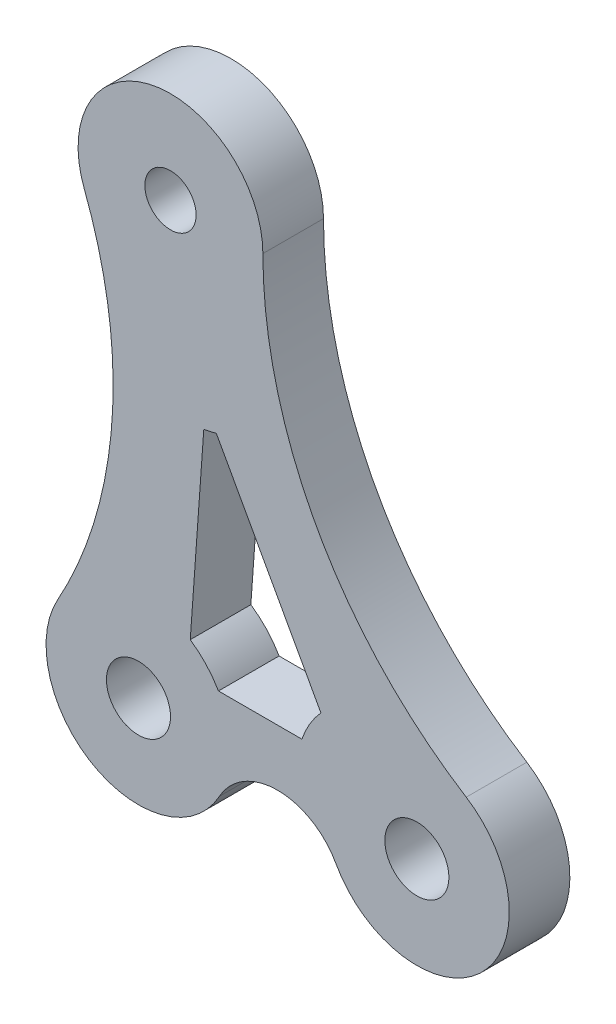
ISO-10303-21;
HEADER;
FILE_DESCRIPTION(('STEP AP214'),'2;1');
FILE_NAME('part.step','',(''),(''),'','','');
FILE_SCHEMA(('AUTOMOTIVE_DESIGN { 1 0 10303 214 1 1 1 1 }'));
ENDSEC;
DATA;
#1=APPLICATION_CONTEXT('core data for automotive mechanical design processes');
#2=APPLICATION_PROTOCOL_DEFINITION('international standard','automotive_design',2000,#1);
#3=PRODUCT_CONTEXT('',#1,'mechanical');
#4=PRODUCT('Part','Part','',(#3));
#5=PRODUCT_RELATED_PRODUCT_CATEGORY('part','',(#4));
#6=PRODUCT_DEFINITION_FORMATION('','',#4);
#7=PRODUCT_DEFINITION_CONTEXT('part definition',#1,'design');
#8=PRODUCT_DEFINITION('design','',#6,#7);
#9=PRODUCT_DEFINITION_SHAPE('','',#8);
#10=(LENGTH_UNIT() NAMED_UNIT(*) SI_UNIT(.MILLI.,.METRE.));
#11=(NAMED_UNIT(*) PLANE_ANGLE_UNIT() SI_UNIT($,.RADIAN.));
#12=(NAMED_UNIT(*) SI_UNIT($,.STERADIAN.) SOLID_ANGLE_UNIT());
#13=UNCERTAINTY_MEASURE_WITH_UNIT(LENGTH_MEASURE(1.E-05),#10,'distance_accuracy_value','');
#14=(GEOMETRIC_REPRESENTATION_CONTEXT(3) GLOBAL_UNCERTAINTY_ASSIGNED_CONTEXT((#13)) GLOBAL_UNIT_ASSIGNED_CONTEXT((#10,
#11,#12)) REPRESENTATION_CONTEXT('',''));
#15=CARTESIAN_POINT('',(0.,0.,0.));
#16=DIRECTION('',(0.,0.,1.));
#17=DIRECTION('',(1.,0.,0.));
#18=AXIS2_PLACEMENT_3D('',#15,#16,#17);
#19=CARTESIAN_POINT('',(0.,0.,3.1242));
#20=DIRECTION('',(0.,0.,1.));
#21=DIRECTION('',(1.,0.,0.));
#22=AXIS2_PLACEMENT_3D('',#19,#20,#21);
#23=PLANE('',#22);
#24=CARTESIAN_POINT('',(12.7,0.,3.1242));
#25=DIRECTION('',(0.,0.,1.));
#26=DIRECTION('',(1.,0.,0.));
#27=AXIS2_PLACEMENT_3D('',#24,#25,#26);
#28=CIRCLE('',#27,1.651);
#29=CARTESIAN_POINT('',(14.351,0.,3.1242));
#30=VERTEX_POINT('',#29);
#31=EDGE_CURVE('E198',#30,#30,#28,.T.);
#32=ORIENTED_EDGE('',*,*,#31,.F.);
#33=EDGE_LOOP('',(#32));
#34=FACE_BOUND('',#33,.T.);
#35=CARTESIAN_POINT('',(-1.651,0.,3.1242));
#36=DIRECTION('',(0.,0.,1.));
#37=DIRECTION('',(1.,0.,0.));
#38=AXIS2_PLACEMENT_3D('',#35,#36,#37);
#39=CIRCLE('',#38,1.651);
#40=CARTESIAN_POINT('',(0.,0.,3.1242));
#41=VERTEX_POINT('',#40);
#42=EDGE_CURVE('E195',#41,#41,#39,.T.);
#43=ORIENTED_EDGE('',*,*,#42,.F.);
#44=EDGE_LOOP('',(#43));
#45=FACE_BOUND('',#44,.T.);
#46=CARTESIAN_POINT('',(0.,23.0505,3.1242));
#47=DIRECTION('',(0.,0.,1.));
#48=DIRECTION('',(1.,0.,0.));
#49=AXIS2_PLACEMENT_3D('',#46,#47,#48);
#50=CIRCLE('',#49,1.3208);
#51=CARTESIAN_POINT('',(1.3208,23.0505,3.1242));
#52=VERTEX_POINT('',#51);
#53=EDGE_CURVE('E192',#52,#52,#50,.T.);
#54=ORIENTED_EDGE('',*,*,#53,.F.);
#55=EDGE_LOOP('',(#54));
#56=FACE_BOUND('',#55,.T.);
#57=CARTESIAN_POINT('',(5.5245,-3.9534435261708,3.1242));
#58=DIRECTION('',(0.,0.,1.));
#59=DIRECTION('',(1.,0.,0.));
#60=AXIS2_PLACEMENT_3D('',#57,#58,#59);
#61=CIRCLE('',#60,3.43002805699326);
#62=CARTESIAN_POINT('',(8.52872118200081,-2.29822524407669,3.1242));
#63=VERTEX_POINT('',#62);
#64=CARTESIAN_POINT('',(2.52027881799918,-2.29822524407669,3.1242));
#65=VERTEX_POINT('',#64);
#66=EDGE_CURVE('E177',#63,#65,#61,.T.);
#67=ORIENTED_EDGE('',*,*,#66,.F.);
#68=CARTESIAN_POINT('',(12.7,0.,3.1242));
#69=DIRECTION('',(0.,0.,1.));
#70=DIRECTION('',(1.,0.,0.));
#71=AXIS2_PLACEMENT_3D('',#68,#69,#70);
#72=CIRCLE('',#71,4.7625);
#73=CARTESIAN_POINT('',(15.2444047674493,4.02584284707951,3.1242));
#74=VERTEX_POINT('',#73);
#75=EDGE_CURVE('E180',#63,#74,#72,.T.);
#76=ORIENTED_EDGE('',*,*,#75,.T.);
#77=CARTESIAN_POINT('',(27.26832875,23.0505,3.1242));
#78=DIRECTION('',(0.,0.,1.));
#79=DIRECTION('',(1.,0.,0.));
#80=AXIS2_PLACEMENT_3D('',#77,#78,#79);
#81=CIRCLE('',#80,22.50582875);
#82=CARTESIAN_POINT('',(4.7625,23.0505,3.1242));
#83=VERTEX_POINT('',#82);
#84=EDGE_CURVE('E183',#83,#74,#81,.T.);
#85=ORIENTED_EDGE('',*,*,#84,.F.);
#86=CARTESIAN_POINT('',(0.,23.0505,3.1242));
#87=DIRECTION('',(0.,0.,1.));
#88=DIRECTION('',(1.,0.,0.));
#89=AXIS2_PLACEMENT_3D('',#86,#87,#88);
#90=CIRCLE('',#89,4.7625);
#91=CARTESIAN_POINT('',(-4.44694129779406,21.3457656089661,3.1242));
#92=VERTEX_POINT('',#91);
#93=EDGE_CURVE('E186',#83,#92,#90,.T.);
#94=ORIENTED_EDGE('',*,*,#93,.T.);
#95=CARTESIAN_POINT('',(-25.4615553260263,13.2898159462168,3.1242));
#96=DIRECTION('',(0.,0.,1.));
#97=DIRECTION('',(1.,0.,0.));
#98=AXIS2_PLACEMENT_3D('',#95,#96,#97);
#99=CIRCLE('',#98,22.50582875);
#100=CARTESIAN_POINT('',(-5.80958891756247,2.32110845604564,3.1242));
#101=VERTEX_POINT('',#100);
#102=EDGE_CURVE('E188',#92,#101,#99,.F.);
#103=ORIENTED_EDGE('',*,*,#102,.T.);
#104=CARTESIAN_POINT('',(-1.651,0.,3.1242));
#105=DIRECTION('',(0.,0.,1.));
#106=DIRECTION('',(1.,0.,0.));
#107=AXIS2_PLACEMENT_3D('',#104,#105,#106);
#108=CIRCLE('',#107,4.7625);
#109=EDGE_CURVE('E190',#101,#65,#108,.T.);
#110=ORIENTED_EDGE('',*,*,#109,.T.);
#111=EDGE_LOOP('',(#67,#76,#85,#94,#103,#110));
#112=FACE_BOUND('',#111,.T.);
#113=DIRECTION('',(-0.482566980383556,0.875859069396154,0.));
#114=VECTOR('',#113,1.);
#115=CARTESIAN_POINT('',(7.65690028093282,4.21867784073434,3.1242));
#116=LINE('',#115,#114);
#117=CARTESIAN_POINT('',(7.75388772630058,4.04264562739184,3.1242));
#118=VERTEX_POINT('',#117);
#119=CARTESIAN_POINT('',(2.36199566709273,13.8289297148541,3.1242));
#120=VERTEX_POINT('',#119);
#121=EDGE_CURVE('E157',#118,#120,#116,.T.);
#122=ORIENTED_EDGE('',*,*,#121,.F.);
#123=CARTESIAN_POINT('',(11.2785483430839,0.839807232077988,3.1242));
#124=DIRECTION('',(0.,0.,1.));
#125=DIRECTION('',(1.,0.,0.));
#126=AXIS2_PLACEMENT_3D('',#123,#124,#125);
#127=CIRCLE('',#126,4.7625);
#128=CARTESIAN_POINT('',(6.77240138107513,2.38125,3.1242));
#129=VERTEX_POINT('',#128);
#130=EDGE_CURVE('E52',#118,#129,#127,.T.);
#131=ORIENTED_EDGE('',*,*,#130,.T.);
#132=DIRECTION('',(1.,0.,0.));
#133=VECTOR('',#132,1.);
#134=CARTESIAN_POINT('',(0.,2.38125,3.1242));
#135=LINE('',#134,#133);
#136=CARTESIAN_POINT('',(2.47344598552339,2.38125,3.1242));
#137=VERTEX_POINT('',#136);
#138=EDGE_CURVE('E143',#137,#129,#135,.T.);
#139=ORIENTED_EDGE('',*,*,#138,.F.);
#140=CARTESIAN_POINT('',(-1.651,0.,3.1242));
#141=DIRECTION('',(0.,0.,1.));
#142=DIRECTION('',(1.,0.,0.));
#143=AXIS2_PLACEMENT_3D('',#140,#141,#142);
#144=CIRCLE('',#143,4.7625);
#145=CARTESIAN_POINT('',(1.01882526947206,3.94378489277603,3.1242));
#146=VERTEX_POINT('',#145);
#147=EDGE_CURVE('E146',#137,#146,#144,.T.);
#148=ORIENTED_EDGE('',*,*,#147,.T.);
#149=DIRECTION('',(-0.0714423224441843,-0.997444732586113,0.));
#150=VECTOR('',#149,1.);
#151=CARTESIAN_POINT('',(0.732591982445878,-0.0524721530126524,3.1242));
#152=LINE('',#151,#150);
#153=CARTESIAN_POINT('',(1.71670874989259,13.6873119463395,3.1242));
#154=VERTEX_POINT('',#153);
#155=EDGE_CURVE('E162',#154,#146,#152,.T.);
#156=ORIENTED_EDGE('',*,*,#155,.F.);
#157=CARTESIAN_POINT('',(1.02090635154567,18.398709326359,3.1242));
#158=DIRECTION('',(0.,0.,1.));
#159=DIRECTION('',(1.,0.,0.));
#160=AXIS2_PLACEMENT_3D('',#157,#158,#159);
#161=CIRCLE('',#160,4.7625);
#162=EDGE_CURVE('E159',#120,#154,#161,.F.);
#163=ORIENTED_EDGE('',*,*,#162,.F.);
#164=EDGE_LOOP('',(#122,#131,#139,#148,#156,#163));
#165=FACE_BOUND('',#164,.T.);
#166=ADVANCED_FACE('F37',(#34,#45,#56,#112,#165),#23,.T.);
#167=CARTESIAN_POINT('',(0.,0.,0.));
#168=DIRECTION('',(0.,0.,1.));
#169=DIRECTION('',(1.,0.,0.));
#170=AXIS2_PLACEMENT_3D('',#167,#168,#169);
#171=PLANE('',#170);
#172=CARTESIAN_POINT('',(12.7,0.,0.));
#173=DIRECTION('',(0.,0.,1.));
#174=DIRECTION('',(1.,0.,0.));
#175=AXIS2_PLACEMENT_3D('',#172,#173,#174);
#176=CIRCLE('',#175,1.651);
#177=CARTESIAN_POINT('',(14.351,0.,0.));
#178=VERTEX_POINT('',#177);
#179=EDGE_CURVE('E181',#178,#178,#176,.T.);
#180=ORIENTED_EDGE('',*,*,#179,.T.);
#181=EDGE_LOOP('',(#180));
#182=FACE_BOUND('',#181,.T.);
#183=CARTESIAN_POINT('',(-1.651,0.,0.));
#184=DIRECTION('',(0.,0.,1.));
#185=DIRECTION('',(1.,0.,0.));
#186=AXIS2_PLACEMENT_3D('',#183,#184,#185);
#187=CIRCLE('',#186,1.651);
#188=CARTESIAN_POINT('',(0.,0.,0.));
#189=VERTEX_POINT('',#188);
#190=EDGE_CURVE('E220',#189,#189,#187,.T.);
#191=ORIENTED_EDGE('',*,*,#190,.T.);
#192=EDGE_LOOP('',(#191));
#193=FACE_BOUND('',#192,.T.);
#194=CARTESIAN_POINT('',(0.,23.0505,0.));
#195=DIRECTION('',(0.,0.,1.));
#196=DIRECTION('',(1.,0.,0.));
#197=AXIS2_PLACEMENT_3D('',#194,#195,#196);
#198=CIRCLE('',#197,1.3208);
#199=CARTESIAN_POINT('',(1.3208,23.0505,0.));
#200=VERTEX_POINT('',#199);
#201=EDGE_CURVE('E217',#200,#200,#198,.T.);
#202=ORIENTED_EDGE('',*,*,#201,.T.);
#203=EDGE_LOOP('',(#202));
#204=FACE_BOUND('',#203,.T.);
#205=CARTESIAN_POINT('',(5.5245,-3.9534435261708,0.));
#206=DIRECTION('',(0.,0.,1.));
#207=DIRECTION('',(1.,0.,0.));
#208=AXIS2_PLACEMENT_3D('',#205,#206,#207);
#209=CIRCLE('',#208,3.43002805699326);
#210=CARTESIAN_POINT('',(8.52872118200081,-2.29822524407669,0.));
#211=VERTEX_POINT('',#210);
#212=CARTESIAN_POINT('',(2.52027881799918,-2.29822524407669,0.));
#213=VERTEX_POINT('',#212);
#214=EDGE_CURVE('E169',#211,#213,#209,.T.);
#215=ORIENTED_EDGE('',*,*,#214,.T.);
#216=CARTESIAN_POINT('',(-1.651,0.,0.));
#217=DIRECTION('',(0.,0.,1.));
#218=DIRECTION('',(1.,0.,0.));
#219=AXIS2_PLACEMENT_3D('',#216,#217,#218);
#220=CIRCLE('',#219,4.7625);
#221=CARTESIAN_POINT('',(-5.80958891756247,2.32110845604564,0.));
#222=VERTEX_POINT('',#221);
#223=EDGE_CURVE('E214',#222,#213,#220,.T.);
#224=ORIENTED_EDGE('',*,*,#223,.F.);
#225=CARTESIAN_POINT('',(-25.4615553260263,13.2898159462168,0.));
#226=DIRECTION('',(0.,0.,1.));
#227=DIRECTION('',(1.,0.,0.));
#228=AXIS2_PLACEMENT_3D('',#225,#226,#227);
#229=CIRCLE('',#228,22.50582875);
#230=CARTESIAN_POINT('',(-4.44694129779406,21.3457656089661,0.));
#231=VERTEX_POINT('',#230);
#232=EDGE_CURVE('E212',#231,#222,#229,.F.);
#233=ORIENTED_EDGE('',*,*,#232,.F.);
#234=CARTESIAN_POINT('',(0.,23.0505,0.));
#235=DIRECTION('',(0.,0.,1.));
#236=DIRECTION('',(1.,0.,0.));
#237=AXIS2_PLACEMENT_3D('',#234,#235,#236);
#238=CIRCLE('',#237,4.7625);
#239=CARTESIAN_POINT('',(4.7625,23.0505,0.));
#240=VERTEX_POINT('',#239);
#241=EDGE_CURVE('E210',#240,#231,#238,.T.);
#242=ORIENTED_EDGE('',*,*,#241,.F.);
#243=CARTESIAN_POINT('',(27.26832875,23.0505,0.));
#244=DIRECTION('',(0.,0.,1.));
#245=DIRECTION('',(1.,0.,0.));
#246=AXIS2_PLACEMENT_3D('',#243,#244,#245);
#247=CIRCLE('',#246,22.50582875);
#248=CARTESIAN_POINT('',(15.2444047674493,4.02584284707951,0.));
#249=VERTEX_POINT('',#248);
#250=EDGE_CURVE('E207',#240,#249,#247,.T.);
#251=ORIENTED_EDGE('',*,*,#250,.T.);
#252=CARTESIAN_POINT('',(12.7,0.,0.));
#253=DIRECTION('',(0.,0.,1.));
#254=DIRECTION('',(1.,0.,0.));
#255=AXIS2_PLACEMENT_3D('',#252,#253,#254);
#256=CIRCLE('',#255,4.7625);
#257=EDGE_CURVE('E204',#211,#249,#256,.T.);
#258=ORIENTED_EDGE('',*,*,#257,.F.);
#259=EDGE_LOOP('',(#215,#224,#233,#242,#251,#258));
#260=FACE_BOUND('',#259,.T.);
#261=CARTESIAN_POINT('',(11.2785483430839,0.839807232077988,0.));
#262=DIRECTION('',(0.,0.,1.));
#263=DIRECTION('',(1.,0.,0.));
#264=AXIS2_PLACEMENT_3D('',#261,#262,#263);
#265=CIRCLE('',#264,4.7625);
#266=CARTESIAN_POINT('',(7.75388772630058,4.04264562739184,0.));
#267=VERTEX_POINT('',#266);
#268=CARTESIAN_POINT('',(6.77240138107513,2.38125,0.));
#269=VERTEX_POINT('',#268);
#270=EDGE_CURVE('E126',#267,#269,#265,.T.);
#271=ORIENTED_EDGE('',*,*,#270,.F.);
#272=DIRECTION('',(-0.482566980383556,0.875859069396154,0.));
#273=VECTOR('',#272,1.);
#274=CARTESIAN_POINT('',(7.65690028093282,4.21867784073434,0.));
#275=LINE('',#274,#273);
#276=CARTESIAN_POINT('',(2.36199566709273,13.8289297148541,0.));
#277=VERTEX_POINT('',#276);
#278=EDGE_CURVE('E135',#267,#277,#275,.T.);
#279=ORIENTED_EDGE('',*,*,#278,.T.);
#280=CARTESIAN_POINT('',(1.02090635154567,18.398709326359,0.));
#281=DIRECTION('',(0.,0.,1.));
#282=DIRECTION('',(1.,0.,0.));
#283=AXIS2_PLACEMENT_3D('',#280,#281,#282);
#284=CIRCLE('',#283,4.7625);
#285=CARTESIAN_POINT('',(1.71670874989259,13.6873119463395,0.));
#286=VERTEX_POINT('',#285);
#287=EDGE_CURVE('E60',#277,#286,#284,.F.);
#288=ORIENTED_EDGE('',*,*,#287,.T.);
#289=DIRECTION('',(-0.0714423224441843,-0.997444732586113,0.));
#290=VECTOR('',#289,1.);
#291=CARTESIAN_POINT('',(0.732591982445878,-0.0524721530126524,0.));
#292=LINE('',#291,#290);
#293=CARTESIAN_POINT('',(1.01882526947206,3.94378489277603,0.));
#294=VERTEX_POINT('',#293);
#295=EDGE_CURVE('E150',#286,#294,#292,.T.);
#296=ORIENTED_EDGE('',*,*,#295,.T.);
#297=CARTESIAN_POINT('',(-1.651,0.,0.));
#298=DIRECTION('',(0.,0.,1.));
#299=DIRECTION('',(1.,0.,0.));
#300=AXIS2_PLACEMENT_3D('',#297,#298,#299);
#301=CIRCLE('',#300,4.7625);
#302=CARTESIAN_POINT('',(2.47344598552339,2.38125,0.));
#303=VERTEX_POINT('',#302);
#304=EDGE_CURVE('E153',#303,#294,#301,.T.);
#305=ORIENTED_EDGE('',*,*,#304,.F.);
#306=DIRECTION('',(1.,0.,0.));
#307=VECTOR('',#306,1.);
#308=CARTESIAN_POINT('',(0.,2.38125,0.));
#309=LINE('',#308,#307);
#310=EDGE_CURVE('E132',#303,#269,#309,.T.);
#311=ORIENTED_EDGE('',*,*,#310,.T.);
#312=EDGE_LOOP('',(#271,#279,#288,#296,#305,#311));
#313=FACE_BOUND('',#312,.T.);
#314=ADVANCED_FACE('F140',(#182,#193,#204,#260,#313),#171,.F.);
#315=CARTESIAN_POINT('',(5.5245,-3.9534435261708,3.1242));
#316=DIRECTION('',(0.,0.,-1.));
#317=DIRECTION('',(-1.,0.,0.));
#318=AXIS2_PLACEMENT_3D('',#315,#316,#317);
#319=CYLINDRICAL_SURFACE('',#318,3.43002805699326);
#320=ORIENTED_EDGE('',*,*,#214,.F.);
#321=DIRECTION('',(0.,0.,-1.));
#322=VECTOR('',#321,1.);
#323=CARTESIAN_POINT('',(8.52872118200081,-2.29822524407669,3.1242));
#324=LINE('',#323,#322);
#325=EDGE_CURVE('E11',#63,#211,#324,.T.);
#326=ORIENTED_EDGE('',*,*,#325,.F.);
#327=ORIENTED_EDGE('',*,*,#66,.T.);
#328=DIRECTION('',(0.,0.,-1.));
#329=VECTOR('',#328,1.);
#330=CARTESIAN_POINT('',(2.52027881799918,-2.29822524407669,3.1242));
#331=LINE('',#330,#329);
#332=EDGE_CURVE('E201',#65,#213,#331,.T.);
#333=ORIENTED_EDGE('',*,*,#332,.T.);
#334=EDGE_LOOP('',(#320,#326,#327,#333));
#335=FACE_BOUND('',#334,.T.);
#336=ADVANCED_FACE('F39',(#335),#319,.F.);
#337=CARTESIAN_POINT('',(12.7,0.,3.1242));
#338=DIRECTION('',(0.,0.,-1.));
#339=DIRECTION('',(-1.,0.,0.));
#340=AXIS2_PLACEMENT_3D('',#337,#338,#339);
#341=CYLINDRICAL_SURFACE('',#340,4.7625);
#342=ORIENTED_EDGE('',*,*,#257,.T.);
#343=DIRECTION('',(0.,0.,-1.));
#344=VECTOR('',#343,1.);
#345=CARTESIAN_POINT('',(15.2444047674493,4.02584284707951,3.1242));
#346=LINE('',#345,#344);
#347=EDGE_CURVE('E45',#74,#249,#346,.T.);
#348=ORIENTED_EDGE('',*,*,#347,.F.);
#349=ORIENTED_EDGE('',*,*,#75,.F.);
#350=ORIENTED_EDGE('',*,*,#325,.T.);
#351=EDGE_LOOP('',(#342,#348,#349,#350));
#352=FACE_BOUND('',#351,.T.);
#353=ADVANCED_FACE('F241',(#352),#341,.T.);
#354=CARTESIAN_POINT('',(27.26832875,23.0505,3.1242));
#355=DIRECTION('',(0.,0.,-1.));
#356=DIRECTION('',(-1.,0.,0.));
#357=AXIS2_PLACEMENT_3D('',#354,#355,#356);
#358=CYLINDRICAL_SURFACE('',#357,22.50582875);
#359=ORIENTED_EDGE('',*,*,#250,.F.);
#360=DIRECTION('',(0.,0.,-1.));
#361=VECTOR('',#360,1.);
#362=CARTESIAN_POINT('',(4.7625,23.0505,3.1242));
#363=LINE('',#362,#361);
#364=EDGE_CURVE('E232',#83,#240,#363,.T.);
#365=ORIENTED_EDGE('',*,*,#364,.F.);
#366=ORIENTED_EDGE('',*,*,#84,.T.);
#367=ORIENTED_EDGE('',*,*,#347,.T.);
#368=EDGE_LOOP('',(#359,#365,#366,#367));
#369=FACE_BOUND('',#368,.T.);
#370=ADVANCED_FACE('F236',(#369),#358,.F.);
#371=CARTESIAN_POINT('',(0.,23.0505,3.1242));
#372=DIRECTION('',(0.,0.,-1.));
#373=DIRECTION('',(-1.,0.,0.));
#374=AXIS2_PLACEMENT_3D('',#371,#372,#373);
#375=CYLINDRICAL_SURFACE('',#374,4.7625);
#376=ORIENTED_EDGE('',*,*,#241,.T.);
#377=DIRECTION('',(0.,0.,-1.));
#378=VECTOR('',#377,1.);
#379=CARTESIAN_POINT('',(-4.44694129779406,21.3457656089661,3.1242));
#380=LINE('',#379,#378);
#381=EDGE_CURVE('E229',#92,#231,#380,.T.);
#382=ORIENTED_EDGE('',*,*,#381,.F.);
#383=ORIENTED_EDGE('',*,*,#93,.F.);
#384=ORIENTED_EDGE('',*,*,#364,.T.);
#385=EDGE_LOOP('',(#376,#382,#383,#384));
#386=FACE_BOUND('',#385,.T.);
#387=ADVANCED_FACE('F249',(#386),#375,.T.);
#388=CARTESIAN_POINT('',(-25.4615553260263,13.2898159462168,3.1242));
#389=DIRECTION('',(0.,0.,-1.));
#390=DIRECTION('',(-1.,0.,0.));
#391=AXIS2_PLACEMENT_3D('',#388,#389,#390);
#392=CYLINDRICAL_SURFACE('',#391,22.50582875);
#393=ORIENTED_EDGE('',*,*,#232,.T.);
#394=DIRECTION('',(0.,0.,-1.));
#395=VECTOR('',#394,1.);
#396=CARTESIAN_POINT('',(-5.80958891756247,2.32110845604564,3.1242));
#397=LINE('',#396,#395);
#398=EDGE_CURVE('E226',#101,#222,#397,.T.);
#399=ORIENTED_EDGE('',*,*,#398,.F.);
#400=ORIENTED_EDGE('',*,*,#102,.F.);
#401=ORIENTED_EDGE('',*,*,#381,.T.);
#402=EDGE_LOOP('',(#393,#399,#400,#401));
#403=FACE_BOUND('',#402,.T.);
#404=ADVANCED_FACE('F253',(#403),#392,.F.);
#405=CARTESIAN_POINT('',(-1.651,0.,3.1242));
#406=DIRECTION('',(0.,0.,-1.));
#407=DIRECTION('',(-1.,0.,0.));
#408=AXIS2_PLACEMENT_3D('',#405,#406,#407);
#409=CYLINDRICAL_SURFACE('',#408,1.651);
#410=ORIENTED_EDGE('',*,*,#42,.T.);
#411=EDGE_LOOP('',(#410));
#412=FACE_BOUND('',#411,.T.);
#413=ORIENTED_EDGE('',*,*,#190,.F.);
#414=EDGE_LOOP('',(#413));
#415=FACE_BOUND('',#414,.T.);
#416=ADVANCED_FACE('F273',(#412,#415),#409,.F.);
#417=CARTESIAN_POINT('',(0.,23.0505,3.1242));
#418=DIRECTION('',(0.,0.,-1.));
#419=DIRECTION('',(-1.,0.,0.));
#420=AXIS2_PLACEMENT_3D('',#417,#418,#419);
#421=CYLINDRICAL_SURFACE('',#420,1.3208);
#422=ORIENTED_EDGE('',*,*,#53,.T.);
#423=EDGE_LOOP('',(#422));
#424=FACE_BOUND('',#423,.T.);
#425=ORIENTED_EDGE('',*,*,#201,.F.);
#426=EDGE_LOOP('',(#425));
#427=FACE_BOUND('',#426,.T.);
#428=ADVANCED_FACE('F265',(#424,#427),#421,.F.);
#429=CARTESIAN_POINT('',(-1.651,0.,3.1242));
#430=DIRECTION('',(0.,0.,-1.));
#431=DIRECTION('',(-1.,0.,0.));
#432=AXIS2_PLACEMENT_3D('',#429,#430,#431);
#433=CYLINDRICAL_SURFACE('',#432,4.7625);
#434=ORIENTED_EDGE('',*,*,#223,.T.);
#435=ORIENTED_EDGE('',*,*,#332,.F.);
#436=ORIENTED_EDGE('',*,*,#109,.F.);
#437=ORIENTED_EDGE('',*,*,#398,.T.);
#438=EDGE_LOOP('',(#434,#435,#436,#437));
#439=FACE_BOUND('',#438,.T.);
#440=ADVANCED_FACE('F262',(#439),#433,.T.);
#441=CARTESIAN_POINT('',(12.7,0.,3.1242));
#442=DIRECTION('',(0.,0.,-1.));
#443=DIRECTION('',(-1.,0.,0.));
#444=AXIS2_PLACEMENT_3D('',#441,#442,#443);
#445=CYLINDRICAL_SURFACE('',#444,1.651);
#446=ORIENTED_EDGE('',*,*,#31,.T.);
#447=EDGE_LOOP('',(#446));
#448=FACE_BOUND('',#447,.T.);
#449=ORIENTED_EDGE('',*,*,#179,.F.);
#450=EDGE_LOOP('',(#449));
#451=FACE_BOUND('',#450,.T.);
#452=ADVANCED_FACE('F264',(#448,#451),#445,.F.);
#453=CARTESIAN_POINT('',(11.2785483430839,0.839807232077988,0.));
#454=DIRECTION('',(0.,0.,1.));
#455=DIRECTION('',(1.,0.,0.));
#456=AXIS2_PLACEMENT_3D('',#453,#454,#455);
#457=CYLINDRICAL_SURFACE('',#456,4.7625);
#458=ORIENTED_EDGE('',*,*,#130,.F.);
#459=DIRECTION('',(0.,0.,1.));
#460=VECTOR('',#459,1.);
#461=CARTESIAN_POINT('',(7.75388772630058,4.04264562739184,0.));
#462=LINE('',#461,#460);
#463=EDGE_CURVE('E122',#267,#118,#462,.T.);
#464=ORIENTED_EDGE('',*,*,#463,.F.);
#465=ORIENTED_EDGE('',*,*,#270,.T.);
#466=DIRECTION('',(0.,0.,1.));
#467=VECTOR('',#466,1.);
#468=CARTESIAN_POINT('',(6.77240138107513,2.38125,0.));
#469=LINE('',#468,#467);
#470=EDGE_CURVE('E167',#269,#129,#469,.T.);
#471=ORIENTED_EDGE('',*,*,#470,.T.);
#472=EDGE_LOOP('',(#458,#464,#465,#471));
#473=FACE_BOUND('',#472,.T.);
#474=ADVANCED_FACE('F124',(#473),#457,.T.);
#475=CARTESIAN_POINT('',(0.,2.38125,0.));
#476=DIRECTION('',(0.,-1.,0.));
#477=DIRECTION('',(0.,0.,-1.));
#478=AXIS2_PLACEMENT_3D('',#475,#476,#477);
#479=PLANE('',#478);
#480=ORIENTED_EDGE('',*,*,#138,.T.);
#481=ORIENTED_EDGE('',*,*,#470,.F.);
#482=ORIENTED_EDGE('',*,*,#310,.F.);
#483=DIRECTION('',(0.,0.,1.));
#484=VECTOR('',#483,1.);
#485=CARTESIAN_POINT('',(2.47344598552339,2.38125,0.));
#486=LINE('',#485,#484);
#487=EDGE_CURVE('E170',#303,#137,#486,.T.);
#488=ORIENTED_EDGE('',*,*,#487,.T.);
#489=EDGE_LOOP('',(#480,#481,#482,#488));
#490=FACE_BOUND('',#489,.T.);
#491=ADVANCED_FACE('F334',(#490),#479,.F.);
#492=CARTESIAN_POINT('',(-1.651,0.,0.));
#493=DIRECTION('',(0.,0.,1.));
#494=DIRECTION('',(1.,0.,0.));
#495=AXIS2_PLACEMENT_3D('',#492,#493,#494);
#496=CYLINDRICAL_SURFACE('',#495,4.7625);
#497=ORIENTED_EDGE('',*,*,#147,.F.);
#498=ORIENTED_EDGE('',*,*,#487,.F.);
#499=ORIENTED_EDGE('',*,*,#304,.T.);
#500=DIRECTION('',(0.,0.,1.));
#501=VECTOR('',#500,1.);
#502=CARTESIAN_POINT('',(1.01882526947206,3.94378489277603,0.));
#503=LINE('',#502,#501);
#504=EDGE_CURVE('E172',#294,#146,#503,.T.);
#505=ORIENTED_EDGE('',*,*,#504,.T.);
#506=EDGE_LOOP('',(#497,#498,#499,#505));
#507=FACE_BOUND('',#506,.T.);
#508=ADVANCED_FACE('F342',(#507),#496,.T.);
#509=CARTESIAN_POINT('',(0.732591982445878,-0.0524721530126524,0.));
#510=DIRECTION('',(-0.997444732586112,0.0714423224441843,0.));
#511=DIRECTION('',(-0.0714423224441843,-0.997444732586112,0.));
#512=AXIS2_PLACEMENT_3D('',#509,#510,#511);
#513=PLANE('',#512);
#514=ORIENTED_EDGE('',*,*,#155,.T.);
#515=ORIENTED_EDGE('',*,*,#504,.F.);
#516=ORIENTED_EDGE('',*,*,#295,.F.);
#517=DIRECTION('',(0.,0.,1.));
#518=VECTOR('',#517,1.);
#519=CARTESIAN_POINT('',(1.71670874989259,13.6873119463395,0.));
#520=LINE('',#519,#518);
#521=EDGE_CURVE('E174',#286,#154,#520,.T.);
#522=ORIENTED_EDGE('',*,*,#521,.T.);
#523=EDGE_LOOP('',(#514,#515,#516,#522));
#524=FACE_BOUND('',#523,.T.);
#525=ADVANCED_FACE('F352',(#524),#513,.F.);
#526=CARTESIAN_POINT('',(1.02090635154567,18.398709326359,0.));
#527=DIRECTION('',(0.,0.,1.));
#528=DIRECTION('',(1.,0.,0.));
#529=AXIS2_PLACEMENT_3D('',#526,#527,#528);
#530=CYLINDRICAL_SURFACE('',#529,4.7625);
#531=ORIENTED_EDGE('',*,*,#162,.T.);
#532=ORIENTED_EDGE('',*,*,#521,.F.);
#533=ORIENTED_EDGE('',*,*,#287,.F.);
#534=DIRECTION('',(0.,0.,1.));
#535=VECTOR('',#534,1.);
#536=CARTESIAN_POINT('',(2.36199566709273,13.8289297148541,0.));
#537=LINE('',#536,#535);
#538=EDGE_CURVE('E131',#277,#120,#537,.T.);
#539=ORIENTED_EDGE('',*,*,#538,.T.);
#540=EDGE_LOOP('',(#531,#532,#533,#539));
#541=FACE_BOUND('',#540,.T.);
#542=ADVANCED_FACE('F362',(#541),#530,.T.);
#543=CARTESIAN_POINT('',(7.65690028093282,4.21867784073434,0.));
#544=DIRECTION('',(0.875859069396154,0.482566980383556,0.));
#545=DIRECTION('',(-0.482566980383556,0.875859069396154,0.));
#546=AXIS2_PLACEMENT_3D('',#543,#544,#545);
#547=PLANE('',#546);
#548=ORIENTED_EDGE('',*,*,#121,.T.);
#549=ORIENTED_EDGE('',*,*,#538,.F.);
#550=ORIENTED_EDGE('',*,*,#278,.F.);
#551=ORIENTED_EDGE('',*,*,#463,.T.);
#552=EDGE_LOOP('',(#548,#549,#550,#551));
#553=FACE_BOUND('',#552,.T.);
#554=ADVANCED_FACE('F136',(#553),#547,.F.);
#555=CLOSED_SHELL('',(#166,#314,#336,#353,#370,#387,#404,#416,#428,#440,#452,#474,#491,#508,
#525,#542,#554));
#556=MANIFOLD_SOLID_BREP('B2',#555);
#557=ADVANCED_BREP_SHAPE_REPRESENTATION('',(#18,#556),#14);
#558=SHAPE_DEFINITION_REPRESENTATION(#9,#557);
ENDSEC;
END-ISO-10303-21;
